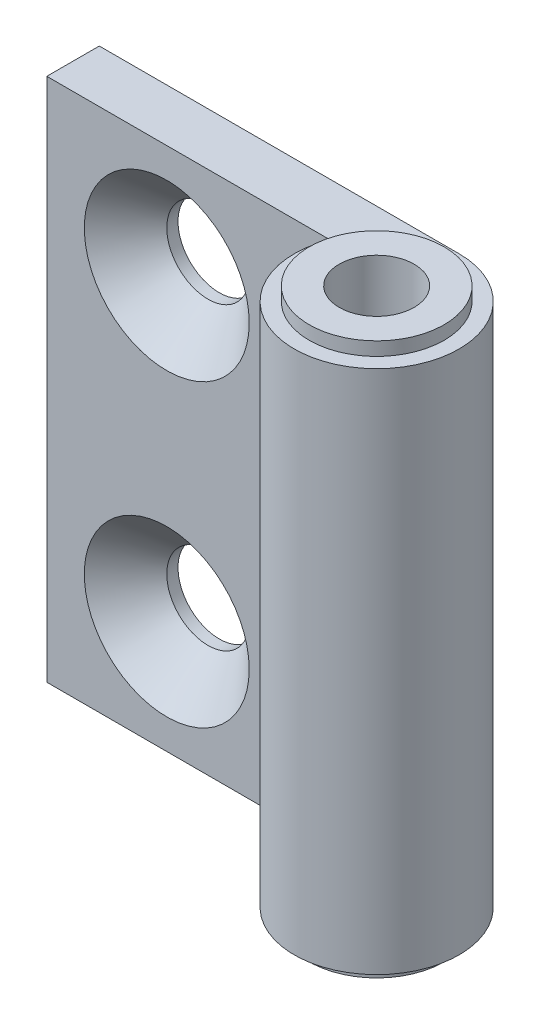
ISO-10303-21;
HEADER;
FILE_DESCRIPTION(('STEP AP214'),'2;1');
FILE_NAME('part.step','',(''),(''),'','','');
FILE_SCHEMA(('AUTOMOTIVE_DESIGN { 1 0 10303 214 1 1 1 1 }'));
ENDSEC;
DATA;
#1=APPLICATION_CONTEXT('core data for automotive mechanical design processes');
#2=APPLICATION_PROTOCOL_DEFINITION('international standard','automotive_design',2000,#1);
#3=PRODUCT_CONTEXT('',#1,'mechanical');
#4=PRODUCT('Part','Part','',(#3));
#5=PRODUCT_RELATED_PRODUCT_CATEGORY('part','',(#4));
#6=PRODUCT_DEFINITION_FORMATION('','',#4);
#7=PRODUCT_DEFINITION_CONTEXT('part definition',#1,'design');
#8=PRODUCT_DEFINITION('design','',#6,#7);
#9=PRODUCT_DEFINITION_SHAPE('','',#8);
#10=(LENGTH_UNIT() NAMED_UNIT(*) SI_UNIT(.MILLI.,.METRE.));
#11=(NAMED_UNIT(*) PLANE_ANGLE_UNIT() SI_UNIT($,.RADIAN.));
#12=(NAMED_UNIT(*) SI_UNIT($,.STERADIAN.) SOLID_ANGLE_UNIT());
#13=UNCERTAINTY_MEASURE_WITH_UNIT(LENGTH_MEASURE(1.E-05),#10,'distance_accuracy_value','');
#14=(GEOMETRIC_REPRESENTATION_CONTEXT(3) GLOBAL_UNCERTAINTY_ASSIGNED_CONTEXT((#13)) GLOBAL_UNIT_ASSIGNED_CONTEXT((#10,
#11,#12)) REPRESENTATION_CONTEXT('',''));
#15=CARTESIAN_POINT('',(0.,0.,0.));
#16=DIRECTION('',(0.,0.,1.));
#17=DIRECTION('',(1.,0.,0.));
#18=AXIS2_PLACEMENT_3D('',#15,#16,#17);
#19=CARTESIAN_POINT('',(0.,0.899999999999998,-5.5));
#20=DIRECTION('',(0.,0.,-1.));
#21=DIRECTION('',(-1.,0.,0.));
#22=AXIS2_PLACEMENT_3D('',#19,#20,#21);
#23=PLANE('',#22);
#24=CARTESIAN_POINT('',(-16.,28.4,-5.5));
#25=DIRECTION('',(0.,0.,1.));
#26=DIRECTION('',(1.,0.,0.));
#27=AXIS2_PLACEMENT_3D('',#24,#25,#26);
#28=CIRCLE('',#27,2.74999999999999);
#29=CARTESIAN_POINT('',(-13.25,28.4,-5.5));
#30=VERTEX_POINT('',#29);
#31=EDGE_CURVE('E190',#30,#30,#28,.T.);
#32=ORIENTED_EDGE('',*,*,#31,.T.);
#33=EDGE_LOOP('',(#32));
#34=FACE_BOUND('',#33,.T.);
#35=CARTESIAN_POINT('',(-16.,8.4,-5.5));
#36=DIRECTION('',(0.,0.,1.));
#37=DIRECTION('',(1.,0.,0.));
#38=AXIS2_PLACEMENT_3D('',#35,#36,#37);
#39=CIRCLE('',#38,2.74999999999999);
#40=CARTESIAN_POINT('',(-13.25,8.4,-5.5));
#41=VERTEX_POINT('',#40);
#42=EDGE_CURVE('E199',#41,#41,#39,.T.);
#43=ORIENTED_EDGE('',*,*,#42,.T.);
#44=EDGE_LOOP('',(#43));
#45=FACE_BOUND('',#44,.T.);
#46=DIRECTION('',(-1.,0.,0.));
#47=VECTOR('',#46,1.);
#48=CARTESIAN_POINT('',(0.,35.9,-5.5));
#49=LINE('',#48,#47);
#50=CARTESIAN_POINT('',(0.,35.9,-5.5));
#51=VERTEX_POINT('',#50);
#52=CARTESIAN_POINT('',(-24.,35.9,-5.5));
#53=VERTEX_POINT('',#52);
#54=EDGE_CURVE('E102',#51,#53,#49,.T.);
#55=ORIENTED_EDGE('',*,*,#54,.F.);
#56=DIRECTION('',(0.,1.,0.));
#57=VECTOR('',#56,1.);
#58=CARTESIAN_POINT('',(0.,0.899999999999998,-5.5));
#59=LINE('',#58,#57);
#60=CARTESIAN_POINT('',(0.,0.899999999999998,-5.5));
#61=VERTEX_POINT('',#60);
#62=EDGE_CURVE('E43',#61,#51,#59,.T.);
#63=ORIENTED_EDGE('',*,*,#62,.F.);
#64=DIRECTION('',(-1.,0.,0.));
#65=VECTOR('',#64,1.);
#66=CARTESIAN_POINT('',(0.,0.899999999999998,-5.5));
#67=LINE('',#66,#65);
#68=CARTESIAN_POINT('',(-24.,0.899999999999998,-5.5));
#69=VERTEX_POINT('',#68);
#70=EDGE_CURVE('E95',#61,#69,#67,.T.);
#71=ORIENTED_EDGE('',*,*,#70,.T.);
#72=DIRECTION('',(0.,1.,0.));
#73=VECTOR('',#72,1.);
#74=CARTESIAN_POINT('',(-24.,0.899999999999998,-5.5));
#75=LINE('',#74,#73);
#76=EDGE_CURVE('E78',#69,#53,#75,.T.);
#77=ORIENTED_EDGE('',*,*,#76,.T.);
#78=EDGE_LOOP('',(#55,#63,#71,#77));
#79=FACE_BOUND('',#78,.T.);
#80=ADVANCED_FACE('F35',(#34,#45,#79),#23,.T.);
#81=CARTESIAN_POINT('',(0.,0.899999999999998,0.));
#82=DIRECTION('',(0.,1.,0.));
#83=DIRECTION('',(0.,0.,1.));
#84=AXIS2_PLACEMENT_3D('',#81,#82,#83);
#85=CYLINDRICAL_SURFACE('',#84,5.5);
#86=CARTESIAN_POINT('',(0.,35.9,0.));
#87=DIRECTION('',(0.,1.,0.));
#88=DIRECTION('',(0.,0.,1.));
#89=AXIS2_PLACEMENT_3D('',#86,#87,#88);
#90=CIRCLE('',#89,5.5);
#91=CARTESIAN_POINT('',(-5.1234753829798,35.9,-2.));
#92=VERTEX_POINT('',#91);
#93=EDGE_CURVE('E97',#92,#51,#90,.T.);
#94=ORIENTED_EDGE('',*,*,#93,.F.);
#95=DIRECTION('',(0.,1.,0.));
#96=VECTOR('',#95,1.);
#97=CARTESIAN_POINT('',(-5.1234753829798,0.899999999999998,-2.));
#98=LINE('',#97,#96);
#99=CARTESIAN_POINT('',(-5.1234753829798,0.899999999999998,-2.));
#100=VERTEX_POINT('',#99);
#101=EDGE_CURVE('E67',#100,#92,#98,.T.);
#102=ORIENTED_EDGE('',*,*,#101,.F.);
#103=CARTESIAN_POINT('',(0.,0.899999999999998,0.));
#104=DIRECTION('',(0.,1.,0.));
#105=DIRECTION('',(0.,0.,1.));
#106=AXIS2_PLACEMENT_3D('',#103,#104,#105);
#107=CIRCLE('',#106,5.5);
#108=EDGE_CURVE('E92',#100,#61,#107,.T.);
#109=ORIENTED_EDGE('',*,*,#108,.T.);
#110=ORIENTED_EDGE('',*,*,#62,.T.);
#111=EDGE_LOOP('',(#94,#102,#109,#110));
#112=FACE_BOUND('',#111,.T.);
#113=ADVANCED_FACE('F114',(#112),#85,.T.);
#114=CARTESIAN_POINT('',(-24.,0.899999999999998,-2.));
#115=DIRECTION('',(0.,0.,1.));
#116=DIRECTION('',(1.,0.,0.));
#117=AXIS2_PLACEMENT_3D('',#114,#115,#116);
#118=PLANE('',#117);
#119=CARTESIAN_POINT('',(-16.,28.4,-2.));
#120=DIRECTION('',(0.,0.,1.));
#121=DIRECTION('',(1.,0.,0.));
#122=AXIS2_PLACEMENT_3D('',#119,#120,#121);
#123=CIRCLE('',#122,5.50000000006403);
#124=CARTESIAN_POINT('',(-10.499999999936,28.4,-2.));
#125=VERTEX_POINT('',#124);
#126=EDGE_CURVE('E182',#125,#125,#123,.T.);
#127=ORIENTED_EDGE('',*,*,#126,.F.);
#128=EDGE_LOOP('',(#127));
#129=FACE_BOUND('',#128,.T.);
#130=CARTESIAN_POINT('',(-16.,8.4,-2.));
#131=DIRECTION('',(0.,0.,1.));
#132=DIRECTION('',(1.,0.,0.));
#133=AXIS2_PLACEMENT_3D('',#130,#131,#132);
#134=CIRCLE('',#133,5.50000000006403);
#135=CARTESIAN_POINT('',(-10.499999999936,8.4,-2.));
#136=VERTEX_POINT('',#135);
#137=EDGE_CURVE('E193',#136,#136,#134,.T.);
#138=ORIENTED_EDGE('',*,*,#137,.F.);
#139=EDGE_LOOP('',(#138));
#140=FACE_BOUND('',#139,.T.);
#141=DIRECTION('',(1.,0.,0.));
#142=VECTOR('',#141,1.);
#143=CARTESIAN_POINT('',(-24.,35.9,-2.));
#144=LINE('',#143,#142);
#145=CARTESIAN_POINT('',(-24.,35.9,-2.));
#146=VERTEX_POINT('',#145);
#147=EDGE_CURVE('E86',#146,#92,#144,.T.);
#148=ORIENTED_EDGE('',*,*,#147,.F.);
#149=DIRECTION('',(0.,1.,0.));
#150=VECTOR('',#149,1.);
#151=CARTESIAN_POINT('',(-24.,0.899999999999998,-2.));
#152=LINE('',#151,#150);
#153=CARTESIAN_POINT('',(-24.,0.899999999999998,-2.));
#154=VERTEX_POINT('',#153);
#155=EDGE_CURVE('E81',#154,#146,#152,.T.);
#156=ORIENTED_EDGE('',*,*,#155,.F.);
#157=DIRECTION('',(1.,0.,0.));
#158=VECTOR('',#157,1.);
#159=CARTESIAN_POINT('',(-24.,0.899999999999998,-2.));
#160=LINE('',#159,#158);
#161=EDGE_CURVE('E84',#154,#100,#160,.T.);
#162=ORIENTED_EDGE('',*,*,#161,.T.);
#163=ORIENTED_EDGE('',*,*,#101,.T.);
#164=EDGE_LOOP('',(#148,#156,#162,#163));
#165=FACE_BOUND('',#164,.T.);
#166=ADVANCED_FACE('F83',(#129,#140,#165),#118,.T.);
#167=CARTESIAN_POINT('',(-24.,0.899999999999998,-5.5));
#168=DIRECTION('',(-1.,0.,0.));
#169=DIRECTION('',(0.,0.,1.));
#170=AXIS2_PLACEMENT_3D('',#167,#168,#169);
#171=PLANE('',#170);
#172=DIRECTION('',(0.,0.,1.));
#173=VECTOR('',#172,1.);
#174=CARTESIAN_POINT('',(-24.,35.9,-5.5));
#175=LINE('',#174,#173);
#176=EDGE_CURVE('E105',#53,#146,#175,.T.);
#177=ORIENTED_EDGE('',*,*,#176,.F.);
#178=ORIENTED_EDGE('',*,*,#76,.F.);
#179=DIRECTION('',(0.,0.,1.));
#180=VECTOR('',#179,1.);
#181=CARTESIAN_POINT('',(-24.,0.899999999999998,-5.5));
#182=LINE('',#181,#180);
#183=EDGE_CURVE('E91',#69,#154,#182,.T.);
#184=ORIENTED_EDGE('',*,*,#183,.T.);
#185=ORIENTED_EDGE('',*,*,#155,.T.);
#186=EDGE_LOOP('',(#177,#178,#184,#185));
#187=FACE_BOUND('',#186,.T.);
#188=ADVANCED_FACE('F94',(#187),#171,.T.);
#189=CARTESIAN_POINT('',(0.,0.899999999999998,0.));
#190=DIRECTION('',(0.,1.,0.));
#191=DIRECTION('',(0.,0.,1.));
#192=AXIS2_PLACEMENT_3D('',#189,#190,#191);
#193=PLANE('',#192);
#194=CARTESIAN_POINT('',(0.,0.899999999999999,0.));
#195=DIRECTION('',(0.,-1.,0.));
#196=DIRECTION('',(0.,0.,-1.));
#197=AXIS2_PLACEMENT_3D('',#194,#195,#196);
#198=CIRCLE('',#197,4.5);
#199=CARTESIAN_POINT('',(0.,0.899999999999999,-4.5));
#200=VERTEX_POINT('',#199);
#201=EDGE_CURVE('E106',#200,#200,#198,.T.);
#202=ORIENTED_EDGE('',*,*,#201,.F.);
#203=EDGE_LOOP('',(#202));
#204=FACE_BOUND('',#203,.T.);
#205=ORIENTED_EDGE('',*,*,#70,.F.);
#206=ORIENTED_EDGE('',*,*,#108,.F.);
#207=ORIENTED_EDGE('',*,*,#161,.F.);
#208=ORIENTED_EDGE('',*,*,#183,.F.);
#209=EDGE_LOOP('',(#205,#206,#207,#208));
#210=FACE_BOUND('',#209,.T.);
#211=ADVANCED_FACE('F90',(#204,#210),#193,.F.);
#212=CARTESIAN_POINT('',(0.,35.9,0.));
#213=DIRECTION('',(0.,1.,0.));
#214=DIRECTION('',(0.,0.,1.));
#215=AXIS2_PLACEMENT_3D('',#212,#213,#214);
#216=PLANE('',#215);
#217=CARTESIAN_POINT('',(0.,35.9,0.));
#218=DIRECTION('',(0.,1.,0.));
#219=DIRECTION('',(0.,0.,1.));
#220=AXIS2_PLACEMENT_3D('',#217,#218,#219);
#221=CIRCLE('',#220,4.5);
#222=CARTESIAN_POINT('',(0.,35.9,4.5));
#223=VERTEX_POINT('',#222);
#224=EDGE_CURVE('E11',#223,#223,#221,.T.);
#225=ORIENTED_EDGE('',*,*,#224,.F.);
#226=EDGE_LOOP('',(#225));
#227=FACE_BOUND('',#226,.T.);
#228=ORIENTED_EDGE('',*,*,#54,.T.);
#229=ORIENTED_EDGE('',*,*,#176,.T.);
#230=ORIENTED_EDGE('',*,*,#147,.T.);
#231=ORIENTED_EDGE('',*,*,#93,.T.);
#232=EDGE_LOOP('',(#228,#229,#230,#231));
#233=FACE_BOUND('',#232,.T.);
#234=ADVANCED_FACE('F113',(#227,#233),#216,.T.);
#235=CARTESIAN_POINT('',(0.,0.899999999999999,0.));
#236=DIRECTION('',(0.,-1.,0.));
#237=DIRECTION('',(0.,0.,-1.));
#238=AXIS2_PLACEMENT_3D('',#235,#236,#237);
#239=CYLINDRICAL_SURFACE('',#238,4.5);
#240=ORIENTED_EDGE('',*,*,#201,.T.);
#241=EDGE_LOOP('',(#240));
#242=FACE_BOUND('',#241,.T.);
#243=CARTESIAN_POINT('',(0.,0.,0.));
#244=DIRECTION('',(0.,-1.,0.));
#245=DIRECTION('',(0.,0.,-1.));
#246=AXIS2_PLACEMENT_3D('',#243,#244,#245);
#247=CIRCLE('',#246,4.5);
#248=CARTESIAN_POINT('',(0.,0.,-4.5));
#249=VERTEX_POINT('',#248);
#250=EDGE_CURVE('E205',#249,#249,#247,.T.);
#251=ORIENTED_EDGE('',*,*,#250,.F.);
#252=EDGE_LOOP('',(#251));
#253=FACE_BOUND('',#252,.T.);
#254=ADVANCED_FACE('F134',(#242,#253),#239,.T.);
#255=CARTESIAN_POINT('',(0.,0.,0.));
#256=DIRECTION('',(0.,-1.,0.));
#257=DIRECTION('',(0.,0.,-1.));
#258=AXIS2_PLACEMENT_3D('',#255,#256,#257);
#259=PLANE('',#258);
#260=CARTESIAN_POINT('',(0.,0.,0.));
#261=DIRECTION('',(0.,1.,0.));
#262=DIRECTION('',(0.,0.,1.));
#263=AXIS2_PLACEMENT_3D('',#260,#261,#262);
#264=CIRCLE('',#263,2.49999999999998);
#265=CARTESIAN_POINT('',(0.,0.,2.49999999999998));
#266=VERTEX_POINT('',#265);
#267=EDGE_CURVE('E177',#266,#266,#264,.T.);
#268=ORIENTED_EDGE('',*,*,#267,.T.);
#269=EDGE_LOOP('',(#268));
#270=FACE_BOUND('',#269,.T.);
#271=ORIENTED_EDGE('',*,*,#250,.T.);
#272=EDGE_LOOP('',(#271));
#273=FACE_BOUND('',#272,.T.);
#274=ADVANCED_FACE('F140',(#270,#273),#259,.T.);
#275=CARTESIAN_POINT('',(0.,36.8,0.));
#276=DIRECTION('',(0.,-1.,0.));
#277=DIRECTION('',(0.,0.,-1.));
#278=AXIS2_PLACEMENT_3D('',#275,#276,#277);
#279=CYLINDRICAL_SURFACE('',#278,4.5);
#280=CARTESIAN_POINT('',(0.,36.8,0.));
#281=DIRECTION('',(0.,-1.,0.));
#282=DIRECTION('',(0.,0.,-1.));
#283=AXIS2_PLACEMENT_3D('',#280,#281,#282);
#284=CIRCLE('',#283,4.5);
#285=CARTESIAN_POINT('',(0.,36.8,-4.5));
#286=VERTEX_POINT('',#285);
#287=EDGE_CURVE('E202',#286,#286,#284,.T.);
#288=ORIENTED_EDGE('',*,*,#287,.T.);
#289=EDGE_LOOP('',(#288));
#290=FACE_BOUND('',#289,.T.);
#291=ORIENTED_EDGE('',*,*,#224,.T.);
#292=EDGE_LOOP('',(#291));
#293=FACE_BOUND('',#292,.T.);
#294=ADVANCED_FACE('F144',(#290,#293),#279,.T.);
#295=CARTESIAN_POINT('',(4.5,36.8,0.));
#296=DIRECTION('',(0.,1.,0.));
#297=DIRECTION('',(0.,0.,1.));
#298=AXIS2_PLACEMENT_3D('',#295,#296,#297);
#299=PLANE('',#298);
#300=CARTESIAN_POINT('',(0.,36.8,0.));
#301=DIRECTION('',(0.,1.,0.));
#302=DIRECTION('',(0.,0.,1.));
#303=AXIS2_PLACEMENT_3D('',#300,#301,#302);
#304=CIRCLE('',#303,2.49999999999999);
#305=CARTESIAN_POINT('',(0.,36.8,2.49999999999999));
#306=VERTEX_POINT('',#305);
#307=EDGE_CURVE('E180',#306,#306,#304,.T.);
#308=ORIENTED_EDGE('',*,*,#307,.F.);
#309=EDGE_LOOP('',(#308));
#310=FACE_BOUND('',#309,.T.);
#311=ORIENTED_EDGE('',*,*,#287,.F.);
#312=EDGE_LOOP('',(#311));
#313=FACE_BOUND('',#312,.T.);
#314=ADVANCED_FACE('F148',(#310,#313),#299,.T.);
#315=CARTESIAN_POINT('',(-16.,8.4,-2.));
#316=DIRECTION('',(0.,0.,1.));
#317=DIRECTION('',(1.,0.,0.));
#318=AXIS2_PLACEMENT_3D('',#315,#316,#317);
#319=CYLINDRICAL_SURFACE('',#318,2.74999999999999);
#320=ORIENTED_EDGE('',*,*,#42,.F.);
#321=EDGE_LOOP('',(#320));
#322=FACE_BOUND('',#321,.T.);
#323=CARTESIAN_POINT('',(-16.,8.4,-4.75000000006402));
#324=DIRECTION('',(0.,0.,1.));
#325=DIRECTION('',(1.,0.,0.));
#326=AXIS2_PLACEMENT_3D('',#323,#324,#325);
#327=CIRCLE('',#326,2.74999999999999);
#328=CARTESIAN_POINT('',(-13.25,8.4,-4.75000000006402));
#329=VERTEX_POINT('',#328);
#330=EDGE_CURVE('E196',#329,#329,#327,.T.);
#331=ORIENTED_EDGE('',*,*,#330,.T.);
#332=EDGE_LOOP('',(#331));
#333=FACE_BOUND('',#332,.T.);
#334=ADVANCED_FACE('F152',(#322,#333),#319,.F.);
#335=CARTESIAN_POINT('',(-16.,8.4,-2.));
#336=DIRECTION('',(0.,0.,1.));
#337=DIRECTION('',(1.,0.,0.));
#338=AXIS2_PLACEMENT_3D('',#335,#336,#337);
#339=CONICAL_SURFACE('',#338,5.50000000006403,0.785398163397452);
#340=ORIENTED_EDGE('',*,*,#330,.F.);
#341=EDGE_LOOP('',(#340));
#342=FACE_BOUND('',#341,.T.);
#343=ORIENTED_EDGE('',*,*,#137,.T.);
#344=EDGE_LOOP('',(#343));
#345=FACE_BOUND('',#344,.T.);
#346=ADVANCED_FACE('F156',(#342,#345),#339,.F.);
#347=CARTESIAN_POINT('',(-16.,28.4,-2.));
#348=DIRECTION('',(0.,0.,1.));
#349=DIRECTION('',(1.,0.,0.));
#350=AXIS2_PLACEMENT_3D('',#347,#348,#349);
#351=CYLINDRICAL_SURFACE('',#350,2.74999999999999);
#352=ORIENTED_EDGE('',*,*,#31,.F.);
#353=EDGE_LOOP('',(#352));
#354=FACE_BOUND('',#353,.T.);
#355=CARTESIAN_POINT('',(-16.,28.4,-4.75000000006402));
#356=DIRECTION('',(0.,0.,1.));
#357=DIRECTION('',(1.,0.,0.));
#358=AXIS2_PLACEMENT_3D('',#355,#356,#357);
#359=CIRCLE('',#358,2.74999999999999);
#360=CARTESIAN_POINT('',(-13.25,28.4,-4.75000000006402));
#361=VERTEX_POINT('',#360);
#362=EDGE_CURVE('E187',#361,#361,#359,.T.);
#363=ORIENTED_EDGE('',*,*,#362,.T.);
#364=EDGE_LOOP('',(#363));
#365=FACE_BOUND('',#364,.T.);
#366=ADVANCED_FACE('F160',(#354,#365),#351,.F.);
#367=CARTESIAN_POINT('',(-16.,28.4,-2.));
#368=DIRECTION('',(0.,0.,1.));
#369=DIRECTION('',(1.,0.,0.));
#370=AXIS2_PLACEMENT_3D('',#367,#368,#369);
#371=CONICAL_SURFACE('',#370,5.50000000006403,0.785398163397452);
#372=ORIENTED_EDGE('',*,*,#362,.F.);
#373=EDGE_LOOP('',(#372));
#374=FACE_BOUND('',#373,.T.);
#375=ORIENTED_EDGE('',*,*,#126,.T.);
#376=EDGE_LOOP('',(#375));
#377=FACE_BOUND('',#376,.T.);
#378=ADVANCED_FACE('F164',(#374,#377),#371,.F.);
#379=CARTESIAN_POINT('',(0.,36.8,0.));
#380=DIRECTION('',(0.,1.,0.));
#381=DIRECTION('',(0.,0.,1.));
#382=AXIS2_PLACEMENT_3D('',#379,#380,#381);
#383=CYLINDRICAL_SURFACE('',#382,2.49999999999999);
#384=ORIENTED_EDGE('',*,*,#267,.F.);
#385=EDGE_LOOP('',(#384));
#386=FACE_BOUND('',#385,.T.);
#387=ORIENTED_EDGE('',*,*,#307,.T.);
#388=EDGE_LOOP('',(#387));
#389=FACE_BOUND('',#388,.T.);
#390=ADVANCED_FACE('F168',(#386,#389),#383,.F.);
#391=CLOSED_SHELL('',(#80,#113,#166,#188,#211,#234,#254,#274,#294,#314,#334,#346,#366,#378,#390));
#392=MANIFOLD_SOLID_BREP('B2',#391);
#393=ADVANCED_BREP_SHAPE_REPRESENTATION('',(#18,#392),#14);
#394=SHAPE_DEFINITION_REPRESENTATION(#9,#393);
ENDSEC;
END-ISO-10303-21;
